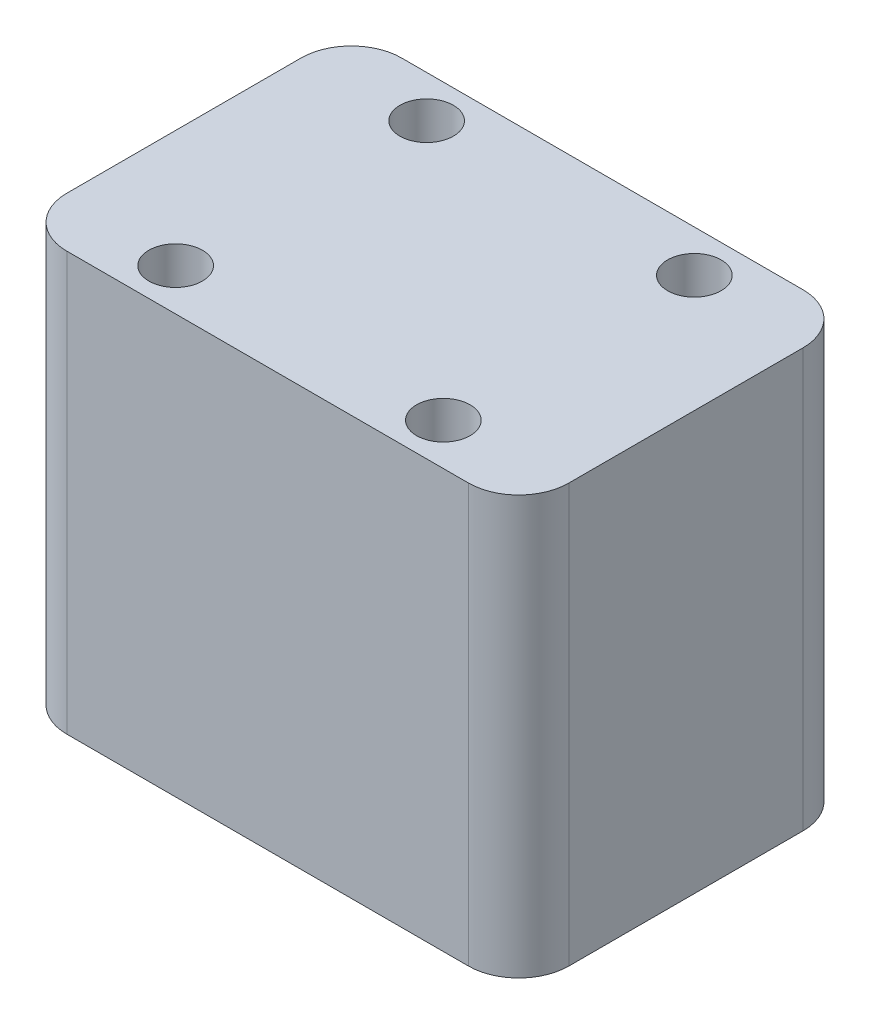
ISO-10303-21;
HEADER;
FILE_DESCRIPTION(('STEP AP214'),'2;1');
FILE_NAME('part.step','',(''),(''),'','','');
FILE_SCHEMA(('AUTOMOTIVE_DESIGN { 1 0 10303 214 1 1 1 1 }'));
ENDSEC;
DATA;
#1=APPLICATION_CONTEXT('core data for automotive mechanical design processes');
#2=APPLICATION_PROTOCOL_DEFINITION('international standard','automotive_design',2000,#1);
#3=PRODUCT_CONTEXT('',#1,'mechanical');
#4=PRODUCT('Part','Part','',(#3));
#5=PRODUCT_RELATED_PRODUCT_CATEGORY('part','',(#4));
#6=PRODUCT_DEFINITION_FORMATION('','',#4);
#7=PRODUCT_DEFINITION_CONTEXT('part definition',#1,'design');
#8=PRODUCT_DEFINITION('design','',#6,#7);
#9=PRODUCT_DEFINITION_SHAPE('','',#8);
#10=(LENGTH_UNIT() NAMED_UNIT(*) SI_UNIT(.MILLI.,.METRE.));
#11=(NAMED_UNIT(*) PLANE_ANGLE_UNIT() SI_UNIT($,.RADIAN.));
#12=(NAMED_UNIT(*) SI_UNIT($,.STERADIAN.) SOLID_ANGLE_UNIT());
#13=UNCERTAINTY_MEASURE_WITH_UNIT(LENGTH_MEASURE(1.E-05),#10,'distance_accuracy_value','');
#14=(GEOMETRIC_REPRESENTATION_CONTEXT(3) GLOBAL_UNCERTAINTY_ASSIGNED_CONTEXT((#13)) GLOBAL_UNIT_ASSIGNED_CONTEXT((#10,
#11,#12)) REPRESENTATION_CONTEXT('',''));
#15=CARTESIAN_POINT('',(0.,0.,0.));
#16=DIRECTION('',(0.,0.,1.));
#17=DIRECTION('',(1.,0.,0.));
#18=AXIS2_PLACEMENT_3D('',#15,#16,#17);
#19=CARTESIAN_POINT('',(0.,25.,0.));
#20=DIRECTION('',(0.,1.,0.));
#21=DIRECTION('',(0.,0.,1.));
#22=AXIS2_PLACEMENT_3D('',#19,#20,#21);
#23=PLANE('',#22);
#24=CARTESIAN_POINT('',(8.,25.,7.5));
#25=DIRECTION('',(0.,1.,0.));
#26=DIRECTION('',(0.,0.,1.));
#27=AXIS2_PLACEMENT_3D('',#24,#25,#26);
#28=CIRCLE('',#27,1.6);
#29=CARTESIAN_POINT('',(8.,25.,9.1));
#30=VERTEX_POINT('',#29);
#31=EDGE_CURVE('E187',#30,#30,#28,.T.);
#32=ORIENTED_EDGE('',*,*,#31,.F.);
#33=EDGE_LOOP('',(#32));
#34=FACE_BOUND('',#33,.T.);
#35=CARTESIAN_POINT('',(-8.00000000000001,25.,-7.5));
#36=DIRECTION('',(0.,1.,0.));
#37=DIRECTION('',(0.,0.,1.));
#38=AXIS2_PLACEMENT_3D('',#35,#36,#37);
#39=CIRCLE('',#38,1.6);
#40=CARTESIAN_POINT('',(-8.00000000000001,25.,-5.9));
#41=VERTEX_POINT('',#40);
#42=EDGE_CURVE('E133',#41,#41,#39,.T.);
#43=ORIENTED_EDGE('',*,*,#42,.F.);
#44=EDGE_LOOP('',(#43));
#45=FACE_BOUND('',#44,.T.);
#46=DIRECTION('',(0.,0.,-1.));
#47=VECTOR('',#46,1.);
#48=CARTESIAN_POINT('',(15.,25.,-10.));
#49=LINE('',#48,#47);
#50=CARTESIAN_POINT('',(15.,25.,7.));
#51=VERTEX_POINT('',#50);
#52=CARTESIAN_POINT('',(15.,25.,-7.));
#53=VERTEX_POINT('',#52);
#54=EDGE_CURVE('E138',#51,#53,#49,.T.);
#55=ORIENTED_EDGE('',*,*,#54,.T.);
#56=CARTESIAN_POINT('',(12.,25.,-7.));
#57=DIRECTION('',(0.,1.,0.));
#58=DIRECTION('',(0.,0.,1.));
#59=AXIS2_PLACEMENT_3D('',#56,#57,#58);
#60=CIRCLE('',#59,3.);
#61=CARTESIAN_POINT('',(12.,25.,-10.));
#62=VERTEX_POINT('',#61);
#63=EDGE_CURVE('E153',#53,#62,#60,.T.);
#64=ORIENTED_EDGE('',*,*,#63,.T.);
#65=DIRECTION('',(-1.,0.,0.));
#66=VECTOR('',#65,1.);
#67=CARTESIAN_POINT('',(-15.,25.,-10.));
#68=LINE('',#67,#66);
#69=CARTESIAN_POINT('',(-12.,25.,-10.));
#70=VERTEX_POINT('',#69);
#71=EDGE_CURVE('E120',#62,#70,#68,.T.);
#72=ORIENTED_EDGE('',*,*,#71,.T.);
#73=CARTESIAN_POINT('',(-12.,25.,-7.));
#74=DIRECTION('',(0.,1.,0.));
#75=DIRECTION('',(0.,0.,1.));
#76=AXIS2_PLACEMENT_3D('',#73,#74,#75);
#77=CIRCLE('',#76,3.);
#78=CARTESIAN_POINT('',(-15.,25.,-7.));
#79=VERTEX_POINT('',#78);
#80=EDGE_CURVE('E151',#70,#79,#77,.T.);
#81=ORIENTED_EDGE('',*,*,#80,.T.);
#82=DIRECTION('',(0.,0.,1.));
#83=VECTOR('',#82,1.);
#84=CARTESIAN_POINT('',(-15.,25.,-10.));
#85=LINE('',#84,#83);
#86=CARTESIAN_POINT('',(-15.,25.,7.));
#87=VERTEX_POINT('',#86);
#88=EDGE_CURVE('E164',#79,#87,#85,.T.);
#89=ORIENTED_EDGE('',*,*,#88,.T.);
#90=CARTESIAN_POINT('',(-12.,25.,7.));
#91=DIRECTION('',(0.,1.,0.));
#92=DIRECTION('',(0.,0.,1.));
#93=AXIS2_PLACEMENT_3D('',#90,#91,#92);
#94=CIRCLE('',#93,3.);
#95=CARTESIAN_POINT('',(-12.,25.,10.));
#96=VERTEX_POINT('',#95);
#97=EDGE_CURVE('E55',#87,#96,#94,.T.);
#98=ORIENTED_EDGE('',*,*,#97,.T.);
#99=DIRECTION('',(1.,0.,0.));
#100=VECTOR('',#99,1.);
#101=CARTESIAN_POINT('',(-15.,25.,10.));
#102=LINE('',#101,#100);
#103=CARTESIAN_POINT('',(12.,25.,10.));
#104=VERTEX_POINT('',#103);
#105=EDGE_CURVE('E139',#96,#104,#102,.T.);
#106=ORIENTED_EDGE('',*,*,#105,.T.);
#107=CARTESIAN_POINT('',(12.,25.,7.));
#108=DIRECTION('',(0.,1.,0.));
#109=DIRECTION('',(0.,0.,1.));
#110=AXIS2_PLACEMENT_3D('',#107,#108,#109);
#111=CIRCLE('',#110,3.);
#112=EDGE_CURVE('E148',#104,#51,#111,.T.);
#113=ORIENTED_EDGE('',*,*,#112,.T.);
#114=EDGE_LOOP('',(#55,#64,#72,#81,#89,#98,#106,#113));
#115=FACE_BOUND('',#114,.T.);
#116=CARTESIAN_POINT('',(-8.,25.,7.5));
#117=DIRECTION('',(0.,1.,0.));
#118=DIRECTION('',(0.,0.,1.));
#119=AXIS2_PLACEMENT_3D('',#116,#117,#118);
#120=CIRCLE('',#119,1.6);
#121=CARTESIAN_POINT('',(-8.,25.,9.1));
#122=VERTEX_POINT('',#121);
#123=EDGE_CURVE('E181',#122,#122,#120,.T.);
#124=ORIENTED_EDGE('',*,*,#123,.F.);
#125=EDGE_LOOP('',(#124));
#126=FACE_BOUND('',#125,.T.);
#127=CARTESIAN_POINT('',(7.99999999999999,25.,-7.5));
#128=DIRECTION('',(0.,1.,0.));
#129=DIRECTION('',(0.,0.,1.));
#130=AXIS2_PLACEMENT_3D('',#127,#128,#129);
#131=CIRCLE('',#130,1.6);
#132=CARTESIAN_POINT('',(7.99999999999999,25.,-5.9));
#133=VERTEX_POINT('',#132);
#134=EDGE_CURVE('E193',#133,#133,#131,.T.);
#135=ORIENTED_EDGE('',*,*,#134,.F.);
#136=EDGE_LOOP('',(#135));
#137=FACE_BOUND('',#136,.T.);
#138=ADVANCED_FACE('F34',(#34,#45,#115,#126,#137),#23,.T.);
#139=CARTESIAN_POINT('',(0.,0.,0.));
#140=DIRECTION('',(0.,1.,0.));
#141=DIRECTION('',(0.,0.,1.));
#142=AXIS2_PLACEMENT_3D('',#139,#140,#141);
#143=PLANE('',#142);
#144=DIRECTION('',(-1.,0.,0.));
#145=VECTOR('',#144,1.);
#146=CARTESIAN_POINT('',(-15.,0.,-10.));
#147=LINE('',#146,#145);
#148=CARTESIAN_POINT('',(12.,0.,-10.));
#149=VERTEX_POINT('',#148);
#150=CARTESIAN_POINT('',(-12.,0.,-10.));
#151=VERTEX_POINT('',#150);
#152=EDGE_CURVE('E117',#149,#151,#147,.T.);
#153=ORIENTED_EDGE('',*,*,#152,.F.);
#154=CARTESIAN_POINT('',(12.,0.,-7.));
#155=DIRECTION('',(0.,1.,0.));
#156=DIRECTION('',(0.,0.,1.));
#157=AXIS2_PLACEMENT_3D('',#154,#155,#156);
#158=CIRCLE('',#157,3.);
#159=CARTESIAN_POINT('',(15.,0.,-7.));
#160=VERTEX_POINT('',#159);
#161=EDGE_CURVE('E100',#149,#160,#158,.F.);
#162=ORIENTED_EDGE('',*,*,#161,.T.);
#163=DIRECTION('',(0.,0.,-1.));
#164=VECTOR('',#163,1.);
#165=CARTESIAN_POINT('',(15.,0.,-10.));
#166=LINE('',#165,#164);
#167=CARTESIAN_POINT('',(15.,0.,7.));
#168=VERTEX_POINT('',#167);
#169=EDGE_CURVE('E128',#168,#160,#166,.T.);
#170=ORIENTED_EDGE('',*,*,#169,.F.);
#171=CARTESIAN_POINT('',(12.,0.,7.));
#172=DIRECTION('',(0.,1.,0.));
#173=DIRECTION('',(0.,0.,1.));
#174=AXIS2_PLACEMENT_3D('',#171,#172,#173);
#175=CIRCLE('',#174,3.);
#176=CARTESIAN_POINT('',(12.,0.,10.));
#177=VERTEX_POINT('',#176);
#178=EDGE_CURVE('E121',#168,#177,#175,.F.);
#179=ORIENTED_EDGE('',*,*,#178,.T.);
#180=DIRECTION('',(1.,0.,0.));
#181=VECTOR('',#180,1.);
#182=CARTESIAN_POINT('',(-15.,0.,10.));
#183=LINE('',#182,#181);
#184=CARTESIAN_POINT('',(-12.,0.,10.));
#185=VERTEX_POINT('',#184);
#186=EDGE_CURVE('E131',#185,#177,#183,.T.);
#187=ORIENTED_EDGE('',*,*,#186,.F.);
#188=CARTESIAN_POINT('',(-12.,0.,7.));
#189=DIRECTION('',(0.,1.,0.));
#190=DIRECTION('',(0.,0.,1.));
#191=AXIS2_PLACEMENT_3D('',#188,#189,#190);
#192=CIRCLE('',#191,3.);
#193=CARTESIAN_POINT('',(-15.,0.,7.));
#194=VERTEX_POINT('',#193);
#195=EDGE_CURVE('E142',#185,#194,#192,.F.);
#196=ORIENTED_EDGE('',*,*,#195,.T.);
#197=DIRECTION('',(0.,0.,1.));
#198=VECTOR('',#197,1.);
#199=CARTESIAN_POINT('',(-15.,0.,-10.));
#200=LINE('',#199,#198);
#201=CARTESIAN_POINT('',(-15.,0.,-7.));
#202=VERTEX_POINT('',#201);
#203=EDGE_CURVE('E127',#202,#194,#200,.T.);
#204=ORIENTED_EDGE('',*,*,#203,.F.);
#205=CARTESIAN_POINT('',(-12.,0.,-7.));
#206=DIRECTION('',(0.,1.,0.));
#207=DIRECTION('',(0.,0.,1.));
#208=AXIS2_PLACEMENT_3D('',#205,#206,#207);
#209=CIRCLE('',#208,3.);
#210=EDGE_CURVE('E111',#202,#151,#209,.F.);
#211=ORIENTED_EDGE('',*,*,#210,.T.);
#212=EDGE_LOOP('',(#153,#162,#170,#179,#187,#196,#204,#211));
#213=FACE_BOUND('',#212,.T.);
#214=CARTESIAN_POINT('',(-8.00000000000001,0.,-7.5));
#215=DIRECTION('',(0.,1.,0.));
#216=DIRECTION('',(0.,0.,1.));
#217=AXIS2_PLACEMENT_3D('',#214,#215,#216);
#218=CIRCLE('',#217,1.6);
#219=CARTESIAN_POINT('',(-8.00000000000001,0.,-5.9));
#220=VERTEX_POINT('',#219);
#221=EDGE_CURVE('E178',#220,#220,#218,.T.);
#222=ORIENTED_EDGE('',*,*,#221,.T.);
#223=EDGE_LOOP('',(#222));
#224=FACE_BOUND('',#223,.T.);
#225=CARTESIAN_POINT('',(-8.,0.,7.5));
#226=DIRECTION('',(0.,1.,0.));
#227=DIRECTION('',(0.,0.,1.));
#228=AXIS2_PLACEMENT_3D('',#225,#226,#227);
#229=CIRCLE('',#228,1.6);
#230=CARTESIAN_POINT('',(-8.,0.,9.1));
#231=VERTEX_POINT('',#230);
#232=EDGE_CURVE('E184',#231,#231,#229,.T.);
#233=ORIENTED_EDGE('',*,*,#232,.T.);
#234=EDGE_LOOP('',(#233));
#235=FACE_BOUND('',#234,.T.);
#236=CARTESIAN_POINT('',(8.,0.,7.5));
#237=DIRECTION('',(0.,1.,0.));
#238=DIRECTION('',(0.,0.,1.));
#239=AXIS2_PLACEMENT_3D('',#236,#237,#238);
#240=CIRCLE('',#239,1.6);
#241=CARTESIAN_POINT('',(8.,0.,9.1));
#242=VERTEX_POINT('',#241);
#243=EDGE_CURVE('E190',#242,#242,#240,.T.);
#244=ORIENTED_EDGE('',*,*,#243,.T.);
#245=EDGE_LOOP('',(#244));
#246=FACE_BOUND('',#245,.T.);
#247=CARTESIAN_POINT('',(7.99999999999999,0.,-7.5));
#248=DIRECTION('',(0.,1.,0.));
#249=DIRECTION('',(0.,0.,1.));
#250=AXIS2_PLACEMENT_3D('',#247,#248,#249);
#251=CIRCLE('',#250,1.6);
#252=CARTESIAN_POINT('',(7.99999999999999,0.,-5.9));
#253=VERTEX_POINT('',#252);
#254=EDGE_CURVE('E196',#253,#253,#251,.T.);
#255=ORIENTED_EDGE('',*,*,#254,.T.);
#256=EDGE_LOOP('',(#255));
#257=FACE_BOUND('',#256,.T.);
#258=ADVANCED_FACE('F124',(#213,#224,#235,#246,#257),#143,.F.);
#259=CARTESIAN_POINT('',(15.,25.,-10.));
#260=DIRECTION('',(-1.,0.,0.));
#261=DIRECTION('',(0.,0.,1.));
#262=AXIS2_PLACEMENT_3D('',#259,#260,#261);
#263=PLANE('',#262);
#264=ORIENTED_EDGE('',*,*,#169,.T.);
#265=DIRECTION('',(0.,-1.,0.));
#266=VECTOR('',#265,1.);
#267=CARTESIAN_POINT('',(15.,25.,-7.));
#268=LINE('',#267,#266);
#269=EDGE_CURVE('E105',#160,#53,#268,.F.);
#270=ORIENTED_EDGE('',*,*,#269,.T.);
#271=ORIENTED_EDGE('',*,*,#54,.F.);
#272=DIRECTION('',(0.,-1.,0.));
#273=VECTOR('',#272,1.);
#274=CARTESIAN_POINT('',(15.,25.,7.));
#275=LINE('',#274,#273);
#276=EDGE_CURVE('E110',#51,#168,#275,.T.);
#277=ORIENTED_EDGE('',*,*,#276,.T.);
#278=EDGE_LOOP('',(#264,#270,#271,#277));
#279=FACE_BOUND('',#278,.T.);
#280=ADVANCED_FACE('F211',(#279),#263,.F.);
#281=CARTESIAN_POINT('',(-15.,25.,-10.));
#282=DIRECTION('',(0.,0.,1.));
#283=DIRECTION('',(1.,0.,0.));
#284=AXIS2_PLACEMENT_3D('',#281,#282,#283);
#285=PLANE('',#284);
#286=ORIENTED_EDGE('',*,*,#71,.F.);
#287=DIRECTION('',(0.,-1.,0.));
#288=VECTOR('',#287,1.);
#289=CARTESIAN_POINT('',(12.,25.,-10.));
#290=LINE('',#289,#288);
#291=EDGE_CURVE('E104',#62,#149,#290,.T.);
#292=ORIENTED_EDGE('',*,*,#291,.T.);
#293=ORIENTED_EDGE('',*,*,#152,.T.);
#294=DIRECTION('',(0.,-1.,0.));
#295=VECTOR('',#294,1.);
#296=CARTESIAN_POINT('',(-12.,25.,-10.));
#297=LINE('',#296,#295);
#298=EDGE_CURVE('E122',#151,#70,#297,.F.);
#299=ORIENTED_EDGE('',*,*,#298,.T.);
#300=EDGE_LOOP('',(#286,#292,#293,#299));
#301=FACE_BOUND('',#300,.T.);
#302=ADVANCED_FACE('F116',(#301),#285,.F.);
#303=CARTESIAN_POINT('',(-15.,25.,-10.));
#304=DIRECTION('',(1.,0.,0.));
#305=DIRECTION('',(0.,0.,-1.));
#306=AXIS2_PLACEMENT_3D('',#303,#304,#305);
#307=PLANE('',#306);
#308=ORIENTED_EDGE('',*,*,#88,.F.);
#309=DIRECTION('',(0.,-1.,0.));
#310=VECTOR('',#309,1.);
#311=CARTESIAN_POINT('',(-15.,25.,-7.));
#312=LINE('',#311,#310);
#313=EDGE_CURVE('E157',#79,#202,#312,.T.);
#314=ORIENTED_EDGE('',*,*,#313,.T.);
#315=ORIENTED_EDGE('',*,*,#203,.T.);
#316=DIRECTION('',(0.,-1.,0.));
#317=VECTOR('',#316,1.);
#318=CARTESIAN_POINT('',(-15.,25.,7.));
#319=LINE('',#318,#317);
#320=EDGE_CURVE('E155',#194,#87,#319,.F.);
#321=ORIENTED_EDGE('',*,*,#320,.T.);
#322=EDGE_LOOP('',(#308,#314,#315,#321));
#323=FACE_BOUND('',#322,.T.);
#324=ADVANCED_FACE('F162',(#323),#307,.F.);
#325=CARTESIAN_POINT('',(-15.,25.,10.));
#326=DIRECTION('',(0.,0.,-1.));
#327=DIRECTION('',(-1.,0.,0.));
#328=AXIS2_PLACEMENT_3D('',#325,#326,#327);
#329=PLANE('',#328);
#330=ORIENTED_EDGE('',*,*,#105,.F.);
#331=DIRECTION('',(0.,-1.,0.));
#332=VECTOR('',#331,1.);
#333=CARTESIAN_POINT('',(-12.,25.,10.));
#334=LINE('',#333,#332);
#335=EDGE_CURVE('E11',#96,#185,#334,.T.);
#336=ORIENTED_EDGE('',*,*,#335,.T.);
#337=ORIENTED_EDGE('',*,*,#186,.T.);
#338=DIRECTION('',(0.,-1.,0.));
#339=VECTOR('',#338,1.);
#340=CARTESIAN_POINT('',(12.,25.,10.));
#341=LINE('',#340,#339);
#342=EDGE_CURVE('E42',#177,#104,#341,.F.);
#343=ORIENTED_EDGE('',*,*,#342,.T.);
#344=EDGE_LOOP('',(#330,#336,#337,#343));
#345=FACE_BOUND('',#344,.T.);
#346=ADVANCED_FACE('F171',(#345),#329,.F.);
#347=CARTESIAN_POINT('',(-8.00000000000001,25.,-7.5));
#348=DIRECTION('',(0.,-1.,0.));
#349=DIRECTION('',(0.,0.,-1.));
#350=AXIS2_PLACEMENT_3D('',#347,#348,#349);
#351=CYLINDRICAL_SURFACE('',#350,1.6);
#352=ORIENTED_EDGE('',*,*,#42,.T.);
#353=EDGE_LOOP('',(#352));
#354=FACE_BOUND('',#353,.T.);
#355=ORIENTED_EDGE('',*,*,#221,.F.);
#356=EDGE_LOOP('',(#355));
#357=FACE_BOUND('',#356,.T.);
#358=ADVANCED_FACE('F216',(#354,#357),#351,.F.);
#359=CARTESIAN_POINT('',(-8.,25.,7.5));
#360=DIRECTION('',(0.,-1.,0.));
#361=DIRECTION('',(0.,0.,-1.));
#362=AXIS2_PLACEMENT_3D('',#359,#360,#361);
#363=CYLINDRICAL_SURFACE('',#362,1.6);
#364=ORIENTED_EDGE('',*,*,#123,.T.);
#365=EDGE_LOOP('',(#364));
#366=FACE_BOUND('',#365,.T.);
#367=ORIENTED_EDGE('',*,*,#232,.F.);
#368=EDGE_LOOP('',(#367));
#369=FACE_BOUND('',#368,.T.);
#370=ADVANCED_FACE('F244',(#366,#369),#363,.F.);
#371=CARTESIAN_POINT('',(8.,25.,7.5));
#372=DIRECTION('',(0.,-1.,0.));
#373=DIRECTION('',(0.,0.,-1.));
#374=AXIS2_PLACEMENT_3D('',#371,#372,#373);
#375=CYLINDRICAL_SURFACE('',#374,1.6);
#376=ORIENTED_EDGE('',*,*,#31,.T.);
#377=EDGE_LOOP('',(#376));
#378=FACE_BOUND('',#377,.T.);
#379=ORIENTED_EDGE('',*,*,#243,.F.);
#380=EDGE_LOOP('',(#379));
#381=FACE_BOUND('',#380,.T.);
#382=ADVANCED_FACE('F247',(#378,#381),#375,.F.);
#383=CARTESIAN_POINT('',(7.99999999999999,25.,-7.5));
#384=DIRECTION('',(0.,-1.,0.));
#385=DIRECTION('',(0.,0.,-1.));
#386=AXIS2_PLACEMENT_3D('',#383,#384,#385);
#387=CYLINDRICAL_SURFACE('',#386,1.6);
#388=ORIENTED_EDGE('',*,*,#134,.T.);
#389=EDGE_LOOP('',(#388));
#390=FACE_BOUND('',#389,.T.);
#391=ORIENTED_EDGE('',*,*,#254,.F.);
#392=EDGE_LOOP('',(#391));
#393=FACE_BOUND('',#392,.T.);
#394=ADVANCED_FACE('F202',(#390,#393),#387,.F.);
#395=CARTESIAN_POINT('',(12.,25.,-7.));
#396=DIRECTION('',(0.,-1.,0.));
#397=DIRECTION('',(0.,0.,-1.));
#398=AXIS2_PLACEMENT_3D('',#395,#396,#397);
#399=CYLINDRICAL_SURFACE('',#398,3.);
#400=ORIENTED_EDGE('',*,*,#63,.F.);
#401=ORIENTED_EDGE('',*,*,#269,.F.);
#402=ORIENTED_EDGE('',*,*,#161,.F.);
#403=ORIENTED_EDGE('',*,*,#291,.F.);
#404=EDGE_LOOP('',(#400,#401,#402,#403));
#405=FACE_BOUND('',#404,.T.);
#406=ADVANCED_FACE('F103',(#405),#399,.T.);
#407=CARTESIAN_POINT('',(-12.,25.,-7.));
#408=DIRECTION('',(0.,-1.,0.));
#409=DIRECTION('',(0.,0.,-1.));
#410=AXIS2_PLACEMENT_3D('',#407,#408,#409);
#411=CYLINDRICAL_SURFACE('',#410,3.);
#412=ORIENTED_EDGE('',*,*,#80,.F.);
#413=ORIENTED_EDGE('',*,*,#298,.F.);
#414=ORIENTED_EDGE('',*,*,#210,.F.);
#415=ORIENTED_EDGE('',*,*,#313,.F.);
#416=EDGE_LOOP('',(#412,#413,#414,#415));
#417=FACE_BOUND('',#416,.T.);
#418=ADVANCED_FACE('F230',(#417),#411,.T.);
#419=CARTESIAN_POINT('',(-12.,25.,7.));
#420=DIRECTION('',(0.,-1.,0.));
#421=DIRECTION('',(0.,0.,-1.));
#422=AXIS2_PLACEMENT_3D('',#419,#420,#421);
#423=CYLINDRICAL_SURFACE('',#422,3.);
#424=ORIENTED_EDGE('',*,*,#97,.F.);
#425=ORIENTED_EDGE('',*,*,#320,.F.);
#426=ORIENTED_EDGE('',*,*,#195,.F.);
#427=ORIENTED_EDGE('',*,*,#335,.F.);
#428=EDGE_LOOP('',(#424,#425,#426,#427));
#429=FACE_BOUND('',#428,.T.);
#430=ADVANCED_FACE('F170',(#429),#423,.T.);
#431=CARTESIAN_POINT('',(12.,25.,7.));
#432=DIRECTION('',(0.,-1.,0.));
#433=DIRECTION('',(0.,0.,-1.));
#434=AXIS2_PLACEMENT_3D('',#431,#432,#433);
#435=CYLINDRICAL_SURFACE('',#434,3.);
#436=ORIENTED_EDGE('',*,*,#112,.F.);
#437=ORIENTED_EDGE('',*,*,#342,.F.);
#438=ORIENTED_EDGE('',*,*,#178,.F.);
#439=ORIENTED_EDGE('',*,*,#276,.F.);
#440=EDGE_LOOP('',(#436,#437,#438,#439));
#441=FACE_BOUND('',#440,.T.);
#442=ADVANCED_FACE('F36',(#441),#435,.T.);
#443=CLOSED_SHELL('',(#138,#258,#280,#302,#324,#346,#358,#370,#382,#394,#406,#418,#430,#442));
#444=MANIFOLD_SOLID_BREP('B2',#443);
#445=ADVANCED_BREP_SHAPE_REPRESENTATION('',(#18,#444),#14);
#446=SHAPE_DEFINITION_REPRESENTATION(#9,#445);
ENDSEC;
END-ISO-10303-21;
